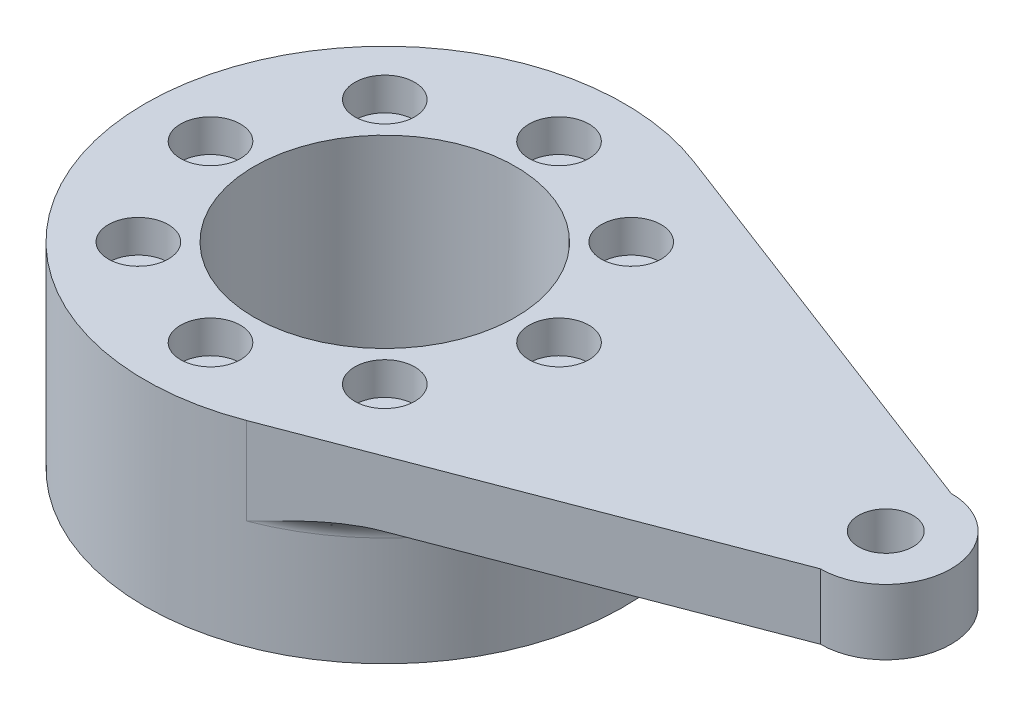
ISO-10303-21;
HEADER;
FILE_DESCRIPTION(('STEP AP214'),'2;1');
FILE_NAME('part.step','',(''),(''),'','','');
FILE_SCHEMA(('AUTOMOTIVE_DESIGN { 1 0 10303 214 1 1 1 1 }'));
ENDSEC;
DATA;
#1=APPLICATION_CONTEXT('core data for automotive mechanical design processes');
#2=APPLICATION_PROTOCOL_DEFINITION('international standard','automotive_design',2000,#1);
#3=PRODUCT_CONTEXT('',#1,'mechanical');
#4=PRODUCT('Part','Part','',(#3));
#5=PRODUCT_RELATED_PRODUCT_CATEGORY('part','',(#4));
#6=PRODUCT_DEFINITION_FORMATION('','',#4);
#7=PRODUCT_DEFINITION_CONTEXT('part definition',#1,'design');
#8=PRODUCT_DEFINITION('design','',#6,#7);
#9=PRODUCT_DEFINITION_SHAPE('','',#8);
#10=(LENGTH_UNIT() NAMED_UNIT(*) SI_UNIT(.MILLI.,.METRE.));
#11=(NAMED_UNIT(*) PLANE_ANGLE_UNIT() SI_UNIT($,.RADIAN.));
#12=(NAMED_UNIT(*) SI_UNIT($,.STERADIAN.) SOLID_ANGLE_UNIT());
#13=UNCERTAINTY_MEASURE_WITH_UNIT(LENGTH_MEASURE(1.E-05),#10,'distance_accuracy_value','');
#14=(GEOMETRIC_REPRESENTATION_CONTEXT(3) GLOBAL_UNCERTAINTY_ASSIGNED_CONTEXT((#13)) GLOBAL_UNIT_ASSIGNED_CONTEXT((#10,
#11,#12)) REPRESENTATION_CONTEXT('',''));
#15=CARTESIAN_POINT('',(0.,0.,0.));
#16=DIRECTION('',(0.,0.,1.));
#17=DIRECTION('',(1.,0.,0.));
#18=AXIS2_PLACEMENT_3D('',#15,#16,#17);
#19=CARTESIAN_POINT('',(-16.,12.,0.));
#20=DIRECTION('',(0.,-1.,0.));
#21=DIRECTION('',(0.,0.,-1.));
#22=AXIS2_PLACEMENT_3D('',#19,#20,#21);
#23=CYLINDRICAL_SURFACE('',#22,1.5);
#24=CARTESIAN_POINT('',(-16.,0.,0.));
#25=DIRECTION('',(0.,1.,0.));
#26=DIRECTION('',(0.,0.,1.));
#27=AXIS2_PLACEMENT_3D('',#24,#25,#26);
#28=CIRCLE('',#27,1.5);
#29=CARTESIAN_POINT('',(-16.,0.,1.5));
#30=VERTEX_POINT('',#29);
#31=EDGE_CURVE('E156',#30,#30,#28,.T.);
#32=ORIENTED_EDGE('',*,*,#31,.F.);
#33=EDGE_LOOP('',(#32));
#34=FACE_BOUND('',#33,.T.);
#35=CARTESIAN_POINT('',(-16.,15.,0.));
#36=DIRECTION('',(0.,1.,0.));
#37=DIRECTION('',(0.,0.,1.));
#38=AXIS2_PLACEMENT_3D('',#35,#36,#37);
#39=CIRCLE('',#38,1.5);
#40=CARTESIAN_POINT('',(-16.,15.,1.5));
#41=VERTEX_POINT('',#40);
#42=EDGE_CURVE('E288',#41,#41,#39,.F.);
#43=ORIENTED_EDGE('',*,*,#42,.F.);
#44=EDGE_LOOP('',(#43));
#45=FACE_BOUND('',#44,.T.);
#46=ADVANCED_FACE('F37',(#34,#45),#23,.F.);
#47=CARTESIAN_POINT('',(-11.3137084989847,12.,-11.3137084989848));
#48=DIRECTION('',(0.,-1.,0.));
#49=DIRECTION('',(0.,0.,-1.));
#50=AXIS2_PLACEMENT_3D('',#47,#48,#49);
#51=CYLINDRICAL_SURFACE('',#50,1.5);
#52=CARTESIAN_POINT('',(-11.3137084989847,0.,-11.3137084989848));
#53=DIRECTION('',(0.,1.,0.));
#54=DIRECTION('',(0.,0.,1.));
#55=AXIS2_PLACEMENT_3D('',#52,#53,#54);
#56=CIRCLE('',#55,1.5);
#57=CARTESIAN_POINT('',(-11.3137084989847,0.,-9.81370849898478));
#58=VERTEX_POINT('',#57);
#59=EDGE_CURVE('E153',#58,#58,#56,.T.);
#60=ORIENTED_EDGE('',*,*,#59,.F.);
#61=EDGE_LOOP('',(#60));
#62=FACE_BOUND('',#61,.T.);
#63=CARTESIAN_POINT('',(-11.3137084989847,15.,-11.3137084989848));
#64=DIRECTION('',(0.,1.,0.));
#65=DIRECTION('',(0.,0.,1.));
#66=AXIS2_PLACEMENT_3D('',#63,#64,#65);
#67=CIRCLE('',#66,1.5);
#68=CARTESIAN_POINT('',(-11.3137084989847,15.,-9.81370849898478));
#69=VERTEX_POINT('',#68);
#70=EDGE_CURVE('E261',#69,#69,#67,.F.);
#71=ORIENTED_EDGE('',*,*,#70,.F.);
#72=EDGE_LOOP('',(#71));
#73=FACE_BOUND('',#72,.T.);
#74=ADVANCED_FACE('F208',(#62,#73),#51,.F.);
#75=CARTESIAN_POINT('',(0.,12.,-16.));
#76=DIRECTION('',(0.,-1.,0.));
#77=DIRECTION('',(0.,0.,-1.));
#78=AXIS2_PLACEMENT_3D('',#75,#76,#77);
#79=CYLINDRICAL_SURFACE('',#78,1.5);
#80=CARTESIAN_POINT('',(0.,0.,-16.));
#81=DIRECTION('',(0.,1.,0.));
#82=DIRECTION('',(0.,0.,1.));
#83=AXIS2_PLACEMENT_3D('',#80,#81,#82);
#84=CIRCLE('',#83,1.5);
#85=CARTESIAN_POINT('',(0.,0.,-14.5));
#86=VERTEX_POINT('',#85);
#87=EDGE_CURVE('E150',#86,#86,#84,.T.);
#88=ORIENTED_EDGE('',*,*,#87,.F.);
#89=EDGE_LOOP('',(#88));
#90=FACE_BOUND('',#89,.T.);
#91=CARTESIAN_POINT('',(0.,15.,-16.));
#92=DIRECTION('',(0.,1.,0.));
#93=DIRECTION('',(0.,0.,1.));
#94=AXIS2_PLACEMENT_3D('',#91,#92,#93);
#95=CIRCLE('',#94,1.5);
#96=CARTESIAN_POINT('',(0.,15.,-14.5));
#97=VERTEX_POINT('',#96);
#98=EDGE_CURVE('E270',#97,#97,#95,.F.);
#99=ORIENTED_EDGE('',*,*,#98,.F.);
#100=EDGE_LOOP('',(#99));
#101=FACE_BOUND('',#100,.T.);
#102=ADVANCED_FACE('F204',(#90,#101),#79,.F.);
#103=CARTESIAN_POINT('',(11.3137084989848,12.,-11.3137084989847));
#104=DIRECTION('',(0.,-1.,0.));
#105=DIRECTION('',(0.,0.,-1.));
#106=AXIS2_PLACEMENT_3D('',#103,#104,#105);
#107=CYLINDRICAL_SURFACE('',#106,1.5);
#108=CARTESIAN_POINT('',(11.3137084989848,0.,-11.3137084989847));
#109=DIRECTION('',(0.,1.,0.));
#110=DIRECTION('',(0.,0.,1.));
#111=AXIS2_PLACEMENT_3D('',#108,#109,#110);
#112=CIRCLE('',#111,1.5);
#113=CARTESIAN_POINT('',(11.3137084989848,0.,-9.8137084989847));
#114=VERTEX_POINT('',#113);
#115=EDGE_CURVE('E147',#114,#114,#112,.T.);
#116=ORIENTED_EDGE('',*,*,#115,.F.);
#117=EDGE_LOOP('',(#116));
#118=FACE_BOUND('',#117,.T.);
#119=CARTESIAN_POINT('',(11.3137084989848,15.,-11.3137084989847));
#120=DIRECTION('',(0.,1.,0.));
#121=DIRECTION('',(0.,0.,1.));
#122=AXIS2_PLACEMENT_3D('',#119,#120,#121);
#123=CIRCLE('',#122,1.5);
#124=CARTESIAN_POINT('',(11.3137084989848,15.,-9.8137084989847));
#125=VERTEX_POINT('',#124);
#126=EDGE_CURVE('E279',#125,#125,#123,.F.);
#127=ORIENTED_EDGE('',*,*,#126,.F.);
#128=EDGE_LOOP('',(#127));
#129=FACE_BOUND('',#128,.T.);
#130=ADVANCED_FACE('F200',(#118,#129),#107,.F.);
#131=CARTESIAN_POINT('',(16.,12.,1.1172740284298E-13));
#132=DIRECTION('',(0.,-1.,0.));
#133=DIRECTION('',(0.,0.,-1.));
#134=AXIS2_PLACEMENT_3D('',#131,#132,#133);
#135=CYLINDRICAL_SURFACE('',#134,1.5);
#136=CARTESIAN_POINT('',(16.,0.,1.1172740284298E-13));
#137=DIRECTION('',(0.,1.,0.));
#138=DIRECTION('',(0.,0.,1.));
#139=AXIS2_PLACEMENT_3D('',#136,#137,#138);
#140=CIRCLE('',#139,1.5);
#141=CARTESIAN_POINT('',(16.,0.,1.50000000000011));
#142=VERTEX_POINT('',#141);
#143=EDGE_CURVE('E144',#142,#142,#140,.T.);
#144=ORIENTED_EDGE('',*,*,#143,.F.);
#145=EDGE_LOOP('',(#144));
#146=FACE_BOUND('',#145,.T.);
#147=CARTESIAN_POINT('',(16.,15.,1.1172740284298E-13));
#148=DIRECTION('',(0.,1.,0.));
#149=DIRECTION('',(0.,0.,1.));
#150=AXIS2_PLACEMENT_3D('',#147,#148,#149);
#151=CIRCLE('',#150,1.5);
#152=CARTESIAN_POINT('',(16.,15.,1.50000000000011));
#153=VERTEX_POINT('',#152);
#154=EDGE_CURVE('E437',#153,#153,#151,.F.);
#155=ORIENTED_EDGE('',*,*,#154,.F.);
#156=EDGE_LOOP('',(#155));
#157=FACE_BOUND('',#156,.T.);
#158=ADVANCED_FACE('F196',(#146,#157),#135,.F.);
#159=CARTESIAN_POINT('',(11.3137084989847,12.,11.3137084989849));
#160=DIRECTION('',(0.,-1.,0.));
#161=DIRECTION('',(0.,0.,-1.));
#162=AXIS2_PLACEMENT_3D('',#159,#160,#161);
#163=CYLINDRICAL_SURFACE('',#162,1.5);
#164=CARTESIAN_POINT('',(11.3137084989847,0.,11.3137084989849));
#165=DIRECTION('',(0.,1.,0.));
#166=DIRECTION('',(0.,0.,1.));
#167=AXIS2_PLACEMENT_3D('',#164,#165,#166);
#168=CIRCLE('',#167,1.5);
#169=CARTESIAN_POINT('',(11.3137084989847,0.,12.8137084989849));
#170=VERTEX_POINT('',#169);
#171=EDGE_CURVE('E141',#170,#170,#168,.T.);
#172=ORIENTED_EDGE('',*,*,#171,.F.);
#173=EDGE_LOOP('',(#172));
#174=FACE_BOUND('',#173,.T.);
#175=CARTESIAN_POINT('',(11.3137084989847,15.,11.3137084989849));
#176=DIRECTION('',(0.,1.,0.));
#177=DIRECTION('',(0.,0.,1.));
#178=AXIS2_PLACEMENT_3D('',#175,#176,#177);
#179=CIRCLE('',#178,1.5);
#180=CARTESIAN_POINT('',(11.3137084989847,15.,12.8137084989849));
#181=VERTEX_POINT('',#180);
#182=EDGE_CURVE('E446',#181,#181,#179,.F.);
#183=ORIENTED_EDGE('',*,*,#182,.F.);
#184=EDGE_LOOP('',(#183));
#185=FACE_BOUND('',#184,.T.);
#186=ADVANCED_FACE('F192',(#174,#185),#163,.F.);
#187=CARTESIAN_POINT('',(-1.6759110426447E-13,12.,16.));
#188=DIRECTION('',(0.,-1.,0.));
#189=DIRECTION('',(0.,0.,-1.));
#190=AXIS2_PLACEMENT_3D('',#187,#188,#189);
#191=CYLINDRICAL_SURFACE('',#190,1.5);
#192=CARTESIAN_POINT('',(-1.6759110426447E-13,0.,16.));
#193=DIRECTION('',(0.,1.,0.));
#194=DIRECTION('',(0.,0.,1.));
#195=AXIS2_PLACEMENT_3D('',#192,#193,#194);
#196=CIRCLE('',#195,1.5);
#197=CARTESIAN_POINT('',(-1.6759110426447E-13,0.,17.5));
#198=VERTEX_POINT('',#197);
#199=EDGE_CURVE('E138',#198,#198,#196,.T.);
#200=ORIENTED_EDGE('',*,*,#199,.F.);
#201=EDGE_LOOP('',(#200));
#202=FACE_BOUND('',#201,.T.);
#203=CARTESIAN_POINT('',(-1.6759110426447E-13,15.,16.));
#204=DIRECTION('',(0.,1.,0.));
#205=DIRECTION('',(0.,0.,1.));
#206=AXIS2_PLACEMENT_3D('',#203,#204,#205);
#207=CIRCLE('',#206,1.5);
#208=CARTESIAN_POINT('',(-1.6759110426447E-13,15.,17.5));
#209=VERTEX_POINT('',#208);
#210=EDGE_CURVE('E455',#209,#209,#207,.F.);
#211=ORIENTED_EDGE('',*,*,#210,.F.);
#212=EDGE_LOOP('',(#211));
#213=FACE_BOUND('',#212,.T.);
#214=ADVANCED_FACE('F188',(#202,#213),#191,.F.);
#215=CARTESIAN_POINT('',(-11.3137084989849,12.,11.3137084989846));
#216=DIRECTION('',(0.,-1.,0.));
#217=DIRECTION('',(0.,0.,-1.));
#218=AXIS2_PLACEMENT_3D('',#215,#216,#217);
#219=CYLINDRICAL_SURFACE('',#218,1.5);
#220=CARTESIAN_POINT('',(-11.3137084989849,0.,11.3137084989846));
#221=DIRECTION('',(0.,1.,0.));
#222=DIRECTION('',(0.,0.,1.));
#223=AXIS2_PLACEMENT_3D('',#220,#221,#222);
#224=CIRCLE('',#223,1.5);
#225=CARTESIAN_POINT('',(-11.3137084989849,0.,12.8137084989846));
#226=VERTEX_POINT('',#225);
#227=EDGE_CURVE('E98',#226,#226,#224,.T.);
#228=ORIENTED_EDGE('',*,*,#227,.F.);
#229=EDGE_LOOP('',(#228));
#230=FACE_BOUND('',#229,.T.);
#231=CARTESIAN_POINT('',(-11.3137084989849,15.,11.3137084989846));
#232=DIRECTION('',(0.,1.,0.));
#233=DIRECTION('',(0.,0.,1.));
#234=AXIS2_PLACEMENT_3D('',#231,#232,#233);
#235=CIRCLE('',#234,1.5);
#236=CARTESIAN_POINT('',(-11.3137084989849,15.,12.8137084989846));
#237=VERTEX_POINT('',#236);
#238=EDGE_CURVE('E246',#237,#237,#235,.F.);
#239=ORIENTED_EDGE('',*,*,#238,.F.);
#240=EDGE_LOOP('',(#239));
#241=FACE_BOUND('',#240,.T.);
#242=ADVANCED_FACE('F184',(#230,#241),#219,.F.);
#243=CARTESIAN_POINT('',(0.,0.,0.));
#244=DIRECTION('',(0.,1.,0.));
#245=DIRECTION('',(0.,0.,1.));
#246=AXIS2_PLACEMENT_3D('',#243,#244,#245);
#247=PLANE('',#246);
#248=CARTESIAN_POINT('',(0.,0.,0.));
#249=DIRECTION('',(0.,1.,0.));
#250=DIRECTION('',(0.,0.,1.));
#251=AXIS2_PLACEMENT_3D('',#248,#249,#250);
#252=CIRCLE('',#251,12.);
#253=CARTESIAN_POINT('',(0.,0.,12.));
#254=VERTEX_POINT('',#253);
#255=EDGE_CURVE('E430',#254,#254,#252,.T.);
#256=ORIENTED_EDGE('',*,*,#255,.T.);
#257=EDGE_LOOP('',(#256));
#258=FACE_BOUND('',#257,.T.);
#259=CARTESIAN_POINT('',(-6.1229349178416,0.,-14.7820725201805));
#260=DIRECTION('',(0.,-1.,0.));
#261=DIRECTION('',(0.,0.,-1.));
#262=AXIS2_PLACEMENT_3D('',#259,#260,#261);
#263=CIRCLE('',#262,2.05);
#264=CARTESIAN_POINT('',(-6.1229349178416,0.,-16.8320725201805));
#265=VERTEX_POINT('',#264);
#266=EDGE_CURVE('E298',#265,#265,#263,.T.);
#267=ORIENTED_EDGE('',*,*,#266,.F.);
#268=EDGE_LOOP('',(#267));
#269=FACE_BOUND('',#268,.T.);
#270=CARTESIAN_POINT('',(-14.7820725201806,0.,6.12293491784145));
#271=DIRECTION('',(0.,-1.,0.));
#272=DIRECTION('',(0.,0.,-1.));
#273=AXIS2_PLACEMENT_3D('',#270,#271,#272);
#274=CIRCLE('',#273,2.05);
#275=CARTESIAN_POINT('',(-14.7820725201806,0.,4.07293491784145));
#276=VERTEX_POINT('',#275);
#277=EDGE_CURVE('E304',#276,#276,#274,.T.);
#278=ORIENTED_EDGE('',*,*,#277,.F.);
#279=EDGE_LOOP('',(#278));
#280=FACE_BOUND('',#279,.T.);
#281=CARTESIAN_POINT('',(14.7820725201805,0.,-6.12293491784155));
#282=DIRECTION('',(0.,-1.,0.));
#283=DIRECTION('',(0.,0.,-1.));
#284=AXIS2_PLACEMENT_3D('',#281,#282,#283);
#285=CIRCLE('',#284,2.05);
#286=CARTESIAN_POINT('',(14.7820725201805,0.,-8.17293491784155));
#287=VERTEX_POINT('',#286);
#288=EDGE_CURVE('E310',#287,#287,#285,.T.);
#289=ORIENTED_EDGE('',*,*,#288,.F.);
#290=EDGE_LOOP('',(#289));
#291=FACE_BOUND('',#290,.T.);
#292=CARTESIAN_POINT('',(6.1229349178415,0.,14.7820725201806));
#293=DIRECTION('',(0.,-1.,0.));
#294=DIRECTION('',(0.,0.,-1.));
#295=AXIS2_PLACEMENT_3D('',#292,#293,#294);
#296=CIRCLE('',#295,2.05);
#297=CARTESIAN_POINT('',(6.1229349178415,0.,12.7320725201806));
#298=VERTEX_POINT('',#297);
#299=EDGE_CURVE('E119',#298,#298,#296,.T.);
#300=ORIENTED_EDGE('',*,*,#299,.F.);
#301=EDGE_LOOP('',(#300));
#302=FACE_BOUND('',#301,.T.);
#303=CARTESIAN_POINT('',(0.,0.,0.));
#304=DIRECTION('',(0.,1.,0.));
#305=DIRECTION('',(0.,0.,1.));
#306=AXIS2_PLACEMENT_3D('',#303,#304,#305);
#307=CIRCLE('',#306,22.);
#308=CARTESIAN_POINT('',(0.,0.,22.));
#309=VERTEX_POINT('',#308);
#310=EDGE_CURVE('E159',#309,#309,#307,.T.);
#311=ORIENTED_EDGE('',*,*,#310,.F.);
#312=EDGE_LOOP('',(#311));
#313=FACE_BOUND('',#312,.T.);
#314=ORIENTED_EDGE('',*,*,#31,.T.);
#315=EDGE_LOOP('',(#314));
#316=FACE_BOUND('',#315,.T.);
#317=ORIENTED_EDGE('',*,*,#59,.T.);
#318=EDGE_LOOP('',(#317));
#319=FACE_BOUND('',#318,.T.);
#320=ORIENTED_EDGE('',*,*,#87,.T.);
#321=EDGE_LOOP('',(#320));
#322=FACE_BOUND('',#321,.T.);
#323=ORIENTED_EDGE('',*,*,#115,.T.);
#324=EDGE_LOOP('',(#323));
#325=FACE_BOUND('',#324,.T.);
#326=ORIENTED_EDGE('',*,*,#143,.T.);
#327=EDGE_LOOP('',(#326));
#328=FACE_BOUND('',#327,.T.);
#329=ORIENTED_EDGE('',*,*,#171,.T.);
#330=EDGE_LOOP('',(#329));
#331=FACE_BOUND('',#330,.T.);
#332=ORIENTED_EDGE('',*,*,#199,.T.);
#333=EDGE_LOOP('',(#332));
#334=FACE_BOUND('',#333,.T.);
#335=ORIENTED_EDGE('',*,*,#227,.T.);
#336=EDGE_LOOP('',(#335));
#337=FACE_BOUND('',#336,.T.);
#338=ADVANCED_FACE('F187',(#258,#269,#280,#291,#302,#313,#316,#319,#322,#325,#328,#331,#334,
#337),#247,.F.);
#339=CARTESIAN_POINT('',(0.,12.,0.));
#340=DIRECTION('',(0.,-1.,0.));
#341=DIRECTION('',(0.,0.,-1.));
#342=AXIS2_PLACEMENT_3D('',#339,#340,#341);
#343=CYLINDRICAL_SURFACE('',#342,22.);
#344=DIRECTION('',(0.,-1.,0.));
#345=VECTOR('',#344,1.);
#346=CARTESIAN_POINT('',(7.84059825550241,18.,-20.5554133744815));
#347=LINE('',#346,#345);
#348=CARTESIAN_POINT('',(7.84059825550241,18.,-20.5554133744815));
#349=VERTEX_POINT('',#348);
#350=CARTESIAN_POINT('',(7.84059825550241,10.,-20.5554133744815));
#351=VERTEX_POINT('',#350);
#352=EDGE_CURVE('E58',#349,#351,#347,.T.);
#353=ORIENTED_EDGE('',*,*,#352,.T.);
#354=CARTESIAN_POINT('',(0.,10.,0.));
#355=DIRECTION('',(0.,1.,0.));
#356=DIRECTION('',(0.,0.,1.));
#357=AXIS2_PLACEMENT_3D('',#354,#355,#356);
#358=CIRCLE('',#357,22.);
#359=CARTESIAN_POINT('',(7.84059825550241,10.,20.5554133744815));
#360=VERTEX_POINT('',#359);
#361=EDGE_CURVE('E165',#351,#360,#358,.F.);
#362=ORIENTED_EDGE('',*,*,#361,.T.);
#363=DIRECTION('',(0.,-1.,0.));
#364=VECTOR('',#363,1.);
#365=CARTESIAN_POINT('',(7.84059825550241,18.,20.5554133744815));
#366=LINE('',#365,#364);
#367=CARTESIAN_POINT('',(7.84059825550241,18.,20.5554133744815));
#368=VERTEX_POINT('',#367);
#369=EDGE_CURVE('E65',#368,#360,#366,.T.);
#370=ORIENTED_EDGE('',*,*,#369,.F.);
#371=CARTESIAN_POINT('',(0.,18.,0.));
#372=DIRECTION('',(0.,1.,0.));
#373=DIRECTION('',(0.,0.,1.));
#374=AXIS2_PLACEMENT_3D('',#371,#372,#373);
#375=CIRCLE('',#374,22.);
#376=EDGE_CURVE('E112',#349,#368,#375,.T.);
#377=ORIENTED_EDGE('',*,*,#376,.F.);
#378=EDGE_LOOP('',(#353,#362,#370,#377));
#379=FACE_BOUND('',#378,.T.);
#380=ORIENTED_EDGE('',*,*,#310,.T.);
#381=EDGE_LOOP('',(#380));
#382=FACE_BOUND('',#381,.T.);
#383=ADVANCED_FACE('F217',(#379,#382),#343,.T.);
#384=CARTESIAN_POINT('',(0.,12.,0.));
#385=DIRECTION('',(0.,1.,0.));
#386=DIRECTION('',(0.,0.,1.));
#387=AXIS2_PLACEMENT_3D('',#384,#385,#386);
#388=PLANE('',#387);
#389=CARTESIAN_POINT('',(46.,12.,0.));
#390=DIRECTION('',(0.,1.,0.));
#391=DIRECTION('',(0.,0.,1.));
#392=AXIS2_PLACEMENT_3D('',#389,#390,#391);
#393=CIRCLE('',#392,2.5);
#394=CARTESIAN_POINT('',(46.,12.,2.5));
#395=VERTEX_POINT('',#394);
#396=EDGE_CURVE('E113',#395,#395,#393,.T.);
#397=ORIENTED_EDGE('',*,*,#396,.T.);
#398=EDGE_LOOP('',(#397));
#399=FACE_BOUND('',#398,.T.);
#400=DIRECTION('',(-0.93433697156734,0.,0.356390829795564));
#401=VECTOR('',#400,1.);
#402=CARTESIAN_POINT('',(7.84059825550241,12.,20.5554133744815));
#403=LINE('',#402,#401);
#404=CARTESIAN_POINT('',(46.,12.,6.));
#405=VERTEX_POINT('',#404);
#406=CARTESIAN_POINT('',(16.8024436587808,12.,17.1370326221752));
#407=VERTEX_POINT('',#406);
#408=EDGE_CURVE('E94',#405,#407,#403,.T.);
#409=ORIENTED_EDGE('',*,*,#408,.T.);
#410=CARTESIAN_POINT('',(0.,12.,0.));
#411=DIRECTION('',(0.,1.,0.));
#412=DIRECTION('',(0.,0.,1.));
#413=AXIS2_PLACEMENT_3D('',#410,#411,#412);
#414=CIRCLE('',#413,24.);
#415=CARTESIAN_POINT('',(16.8024436587808,12.,-17.1370326221752));
#416=VERTEX_POINT('',#415);
#417=EDGE_CURVE('E162',#407,#416,#414,.T.);
#418=ORIENTED_EDGE('',*,*,#417,.T.);
#419=DIRECTION('',(-0.93433697156734,0.,-0.356390829795564));
#420=VECTOR('',#419,1.);
#421=CARTESIAN_POINT('',(7.84059825550241,12.,-20.5554133744815));
#422=LINE('',#421,#420);
#423=CARTESIAN_POINT('',(46.,12.,-6.));
#424=VERTEX_POINT('',#423);
#425=EDGE_CURVE('E116',#424,#416,#422,.T.);
#426=ORIENTED_EDGE('',*,*,#425,.F.);
#427=CARTESIAN_POINT('',(46.,12.,0.));
#428=DIRECTION('',(0.,1.,0.));
#429=DIRECTION('',(0.,0.,1.));
#430=AXIS2_PLACEMENT_3D('',#427,#428,#429);
#431=CIRCLE('',#430,6.);
#432=EDGE_CURVE('E128',#405,#424,#431,.T.);
#433=ORIENTED_EDGE('',*,*,#432,.F.);
#434=EDGE_LOOP('',(#409,#418,#426,#433));
#435=FACE_BOUND('',#434,.T.);
#436=ADVANCED_FACE('F183',(#399,#435),#388,.F.);
#437=CARTESIAN_POINT('',(7.84059825550241,18.,20.5554133744815));
#438=DIRECTION('',(0.356390829795564,0.,0.93433697156734));
#439=DIRECTION('',(0.934336971567341,0.,-0.356390829795564));
#440=AXIS2_PLACEMENT_3D('',#437,#438,#439);
#441=PLANE('',#440);
#442=ORIENTED_EDGE('',*,*,#408,.F.);
#443=DIRECTION('',(0.,-1.,0.));
#444=VECTOR('',#443,1.);
#445=CARTESIAN_POINT('',(46.,18.,6.));
#446=LINE('',#445,#444);
#447=CARTESIAN_POINT('',(46.,18.,6.));
#448=VERTEX_POINT('',#447);
#449=EDGE_CURVE('E88',#448,#405,#446,.T.);
#450=ORIENTED_EDGE('',*,*,#449,.F.);
#451=DIRECTION('',(-0.93433697156734,0.,0.356390829795564));
#452=VECTOR('',#451,1.);
#453=CARTESIAN_POINT('',(7.84059825550241,18.,20.5554133744815));
#454=LINE('',#453,#452);
#455=EDGE_CURVE('E92',#448,#368,#454,.T.);
#456=ORIENTED_EDGE('',*,*,#455,.T.);
#457=ORIENTED_EDGE('',*,*,#369,.T.);
#458=CARTESIAN_POINT('',(16.8024436587808,12.,17.1370326221752));
#459=CARTESIAN_POINT('',(16.6447027714641,11.9999762948153,17.1972008563715));
#460=CARTESIAN_POINT('',(16.486989567504,11.9965866675517,17.2573585311071));
#461=CARTESIAN_POINT('',(16.1718203242431,11.9838003751437,17.3775757884242));
#462=CARTESIAN_POINT('',(16.0143642209264,11.9744055518785,17.4376353954237));
#463=CARTESIAN_POINT('',(15.7000352549024,11.9503496997234,17.557532139788));
#464=CARTESIAN_POINT('',(15.5431618833756,11.9356960954993,17.6173694712354));
#465=CARTESIAN_POINT('',(15.2298514174152,11.9017004091527,17.73687772184));
#466=CARTESIAN_POINT('',(15.0734143619755,11.8823579207548,17.7965486261235));
#467=CARTESIAN_POINT('',(14.6065213430878,11.8183145852962,17.9746389677141));
#468=CARTESIAN_POINT('',(14.2967966939894,11.7674570730959,18.0927794545613));
#469=CARTESIAN_POINT('',(13.679402370757,11.6526128471442,18.3282765844659));
#470=CARTESIAN_POINT('',(13.3717336256647,11.5886205641736,18.4456328731523));
#471=CARTESIAN_POINT('',(12.6260706411212,11.4203652927699,18.7300564354175));
#472=CARTESIAN_POINT('',(12.1891587086289,11.3106439280728,18.8967108769167));
#473=CARTESIAN_POINT('',(11.3189029453068,11.0763949836736,19.2286587533926));
#474=CARTESIAN_POINT('',(10.8855590284351,10.9518677621369,19.393952221189));
#475=CARTESIAN_POINT('',(9.58798236063764,10.5638342234291,19.8888961647899));
#476=CARTESIAN_POINT('',(8.72749804892183,10.2862028437589,20.2171168466324));
#477=CARTESIAN_POINT('',(7.85828953115385,10.0057089732058,20.5486652647508));
#478=CARTESIAN_POINT('',(7.84944388955644,10.0028544768059,20.5520393210548));
#479=CARTESIAN_POINT('',(7.84059825550242,10.,20.5554133744815));
#480=B_SPLINE_CURVE_WITH_KNOTS('',3,(#458,#459,#460,#461,#462,#463,#464,#465,#466,#467,#468,
#469,#470,#471,#472,#473,#474,#475,#476,#477,#478,#479),.UNSPECIFIED.,.F.,.F.,(4,2,2,2,2,2,2,2,
2,2,4),(0.,0.506403608546306,1.01265197037599,1.51818837400446,2.02376859625181,
3.02950309914149,4.03566492350481,5.47622525419607,6.91675074369697,9.80206434583899,
9.83172913978732),.UNSPECIFIED.);
#481=EDGE_CURVE('E11',#360,#407,#480,.F.);
#482=ORIENTED_EDGE('',*,*,#481,.T.);
#483=EDGE_LOOP('',(#442,#450,#456,#457,#482));
#484=FACE_BOUND('',#483,.T.);
#485=ADVANCED_FACE('F90',(#484),#441,.T.);
#486=CARTESIAN_POINT('',(46.,18.,0.));
#487=DIRECTION('',(0.,-1.,0.));
#488=DIRECTION('',(0.,0.,-1.));
#489=AXIS2_PLACEMENT_3D('',#486,#487,#488);
#490=CYLINDRICAL_SURFACE('',#489,6.);
#491=ORIENTED_EDGE('',*,*,#432,.T.);
#492=DIRECTION('',(0.,-1.,0.));
#493=VECTOR('',#492,1.);
#494=CARTESIAN_POINT('',(46.,18.,-6.));
#495=LINE('',#494,#493);
#496=CARTESIAN_POINT('',(46.,18.,-6.));
#497=VERTEX_POINT('',#496);
#498=EDGE_CURVE('E99',#497,#424,#495,.T.);
#499=ORIENTED_EDGE('',*,*,#498,.F.);
#500=CARTESIAN_POINT('',(46.,18.,0.));
#501=DIRECTION('',(0.,1.,0.));
#502=DIRECTION('',(0.,0.,1.));
#503=AXIS2_PLACEMENT_3D('',#500,#501,#502);
#504=CIRCLE('',#503,6.);
#505=EDGE_CURVE('E103',#448,#497,#504,.T.);
#506=ORIENTED_EDGE('',*,*,#505,.F.);
#507=ORIENTED_EDGE('',*,*,#449,.T.);
#508=EDGE_LOOP('',(#491,#499,#506,#507));
#509=FACE_BOUND('',#508,.T.);
#510=ADVANCED_FACE('F104',(#509),#490,.T.);
#511=CARTESIAN_POINT('',(7.84059825550241,18.,-20.5554133744815));
#512=DIRECTION('',(-0.356390829795564,0.,0.93433697156734));
#513=DIRECTION('',(0.934336971567341,0.,0.356390829795564));
#514=AXIS2_PLACEMENT_3D('',#511,#512,#513);
#515=PLANE('',#514);
#516=ORIENTED_EDGE('',*,*,#425,.T.);
#517=CARTESIAN_POINT('',(16.8024436587808,12.,-17.1370326221752));
#518=CARTESIAN_POINT('',(16.6447027714641,11.9999762948153,-17.1972008563715));
#519=CARTESIAN_POINT('',(16.486989567504,11.9965866675517,-17.2573585311071));
#520=CARTESIAN_POINT('',(16.1718203242431,11.9838003751437,-17.3775757884242));
#521=CARTESIAN_POINT('',(16.0143642209264,11.9744055518785,-17.4376353954237));
#522=CARTESIAN_POINT('',(15.7000352549024,11.9503496997234,-17.557532139788));
#523=CARTESIAN_POINT('',(15.5431618833756,11.9356960954993,-17.6173694712354));
#524=CARTESIAN_POINT('',(15.2298514174152,11.9017004091527,-17.73687772184));
#525=CARTESIAN_POINT('',(15.0734143619755,11.8823579207548,-17.7965486261235));
#526=CARTESIAN_POINT('',(14.6065213430878,11.8183145852962,-17.9746389677141));
#527=CARTESIAN_POINT('',(14.2967966939894,11.7674570730959,-18.0927794545613));
#528=CARTESIAN_POINT('',(13.679402370757,11.6526128471442,-18.3282765844659));
#529=CARTESIAN_POINT('',(13.3717336256647,11.5886205641736,-18.4456328731523));
#530=CARTESIAN_POINT('',(12.6260706411212,11.4203652927699,-18.7300564354175));
#531=CARTESIAN_POINT('',(12.1891587086289,11.3106439280728,-18.8967108769167));
#532=CARTESIAN_POINT('',(11.3189029453068,11.0763949836736,-19.2286587533926));
#533=CARTESIAN_POINT('',(10.8855590284351,10.9518677621369,-19.393952221189));
#534=CARTESIAN_POINT('',(9.58798236063764,10.5638342234291,-19.8888961647899));
#535=CARTESIAN_POINT('',(8.72749804892183,10.2862028437589,-20.2171168466324));
#536=CARTESIAN_POINT('',(7.85828953115385,10.0057089732058,-20.5486652647508));
#537=CARTESIAN_POINT('',(7.84944388955644,10.0028544768059,-20.5520393210548));
#538=CARTESIAN_POINT('',(7.84059825550242,10.,-20.5554133744815));
#539=B_SPLINE_CURVE_WITH_KNOTS('',3,(#517,#518,#519,#520,#521,#522,#523,#524,#525,#526,#527,
#528,#529,#530,#531,#532,#533,#534,#535,#536,#537,#538),.UNSPECIFIED.,.F.,.F.,(4,2,2,2,2,2,2,2,
2,2,4),(0.,0.506403608546306,1.01265197037599,1.51818837400446,2.02376859625181,
3.02950309914149,4.03566492350481,5.47622525419607,6.91675074369697,9.80206434583899,
9.83172913978732),.UNSPECIFIED.);
#540=EDGE_CURVE('E51',#416,#351,#539,.T.);
#541=ORIENTED_EDGE('',*,*,#540,.T.);
#542=ORIENTED_EDGE('',*,*,#352,.F.);
#543=DIRECTION('',(-0.93433697156734,0.,-0.356390829795564));
#544=VECTOR('',#543,1.);
#545=CARTESIAN_POINT('',(7.84059825550241,18.,-20.5554133744815));
#546=LINE('',#545,#544);
#547=EDGE_CURVE('E108',#497,#349,#546,.T.);
#548=ORIENTED_EDGE('',*,*,#547,.F.);
#549=ORIENTED_EDGE('',*,*,#498,.T.);
#550=EDGE_LOOP('',(#516,#541,#542,#548,#549));
#551=FACE_BOUND('',#550,.T.);
#552=ADVANCED_FACE('F171',(#551),#515,.F.);
#553=CARTESIAN_POINT('',(46.,18.,0.));
#554=DIRECTION('',(0.,-1.,0.));
#555=DIRECTION('',(0.,0.,-1.));
#556=AXIS2_PLACEMENT_3D('',#553,#554,#555);
#557=CYLINDRICAL_SURFACE('',#556,2.5);
#558=CARTESIAN_POINT('',(46.,18.,0.));
#559=DIRECTION('',(0.,1.,0.));
#560=DIRECTION('',(0.,0.,1.));
#561=AXIS2_PLACEMENT_3D('',#558,#559,#560);
#562=CIRCLE('',#561,2.5);
#563=CARTESIAN_POINT('',(46.,18.,2.5));
#564=VERTEX_POINT('',#563);
#565=EDGE_CURVE('E124',#564,#564,#562,.T.);
#566=ORIENTED_EDGE('',*,*,#565,.T.);
#567=EDGE_LOOP('',(#566));
#568=FACE_BOUND('',#567,.T.);
#569=ORIENTED_EDGE('',*,*,#396,.F.);
#570=EDGE_LOOP('',(#569));
#571=FACE_BOUND('',#570,.T.);
#572=ADVANCED_FACE('F176',(#568,#571),#557,.F.);
#573=CARTESIAN_POINT('',(0.,18.,0.));
#574=DIRECTION('',(0.,1.,0.));
#575=DIRECTION('',(0.,0.,1.));
#576=AXIS2_PLACEMENT_3D('',#573,#574,#575);
#577=PLANE('',#576);
#578=CARTESIAN_POINT('',(0.,18.,0.));
#579=DIRECTION('',(0.,1.,0.));
#580=DIRECTION('',(0.,0.,1.));
#581=AXIS2_PLACEMENT_3D('',#578,#579,#580);
#582=CIRCLE('',#581,12.);
#583=CARTESIAN_POINT('',(0.,18.,12.));
#584=VERTEX_POINT('',#583);
#585=EDGE_CURVE('E433',#584,#584,#582,.T.);
#586=ORIENTED_EDGE('',*,*,#585,.F.);
#587=EDGE_LOOP('',(#586));
#588=FACE_BOUND('',#587,.T.);
#589=CARTESIAN_POINT('',(-11.3137084989849,18.,11.3137084989846));
#590=DIRECTION('',(0.,1.,0.));
#591=DIRECTION('',(0.,0.,1.));
#592=AXIS2_PLACEMENT_3D('',#589,#590,#591);
#593=CIRCLE('',#592,2.75);
#594=CARTESIAN_POINT('',(-11.3137084989849,18.,14.0637084989846));
#595=VERTEX_POINT('',#594);
#596=EDGE_CURVE('E249',#595,#595,#593,.T.);
#597=ORIENTED_EDGE('',*,*,#596,.F.);
#598=EDGE_LOOP('',(#597));
#599=FACE_BOUND('',#598,.T.);
#600=CARTESIAN_POINT('',(-11.3137084989847,18.,-11.3137084989848));
#601=DIRECTION('',(0.,1.,0.));
#602=DIRECTION('',(0.,0.,1.));
#603=AXIS2_PLACEMENT_3D('',#600,#601,#602);
#604=CIRCLE('',#603,2.75);
#605=CARTESIAN_POINT('',(-11.3137084989847,18.,-8.56370849898479));
#606=VERTEX_POINT('',#605);
#607=EDGE_CURVE('E264',#606,#606,#604,.T.);
#608=ORIENTED_EDGE('',*,*,#607,.F.);
#609=EDGE_LOOP('',(#608));
#610=FACE_BOUND('',#609,.T.);
#611=CARTESIAN_POINT('',(0.,18.,-16.));
#612=DIRECTION('',(0.,1.,0.));
#613=DIRECTION('',(0.,0.,1.));
#614=AXIS2_PLACEMENT_3D('',#611,#612,#613);
#615=CIRCLE('',#614,2.75);
#616=CARTESIAN_POINT('',(0.,18.,-13.25));
#617=VERTEX_POINT('',#616);
#618=EDGE_CURVE('E273',#617,#617,#615,.T.);
#619=ORIENTED_EDGE('',*,*,#618,.F.);
#620=EDGE_LOOP('',(#619));
#621=FACE_BOUND('',#620,.T.);
#622=CARTESIAN_POINT('',(11.3137084989848,18.,-11.3137084989847));
#623=DIRECTION('',(0.,1.,0.));
#624=DIRECTION('',(0.,0.,1.));
#625=AXIS2_PLACEMENT_3D('',#622,#623,#624);
#626=CIRCLE('',#625,2.75);
#627=CARTESIAN_POINT('',(11.3137084989848,18.,-8.5637084989847));
#628=VERTEX_POINT('',#627);
#629=EDGE_CURVE('E282',#628,#628,#626,.T.);
#630=ORIENTED_EDGE('',*,*,#629,.F.);
#631=EDGE_LOOP('',(#630));
#632=FACE_BOUND('',#631,.T.);
#633=CARTESIAN_POINT('',(16.,18.,1.1172740284298E-13));
#634=DIRECTION('',(0.,1.,0.));
#635=DIRECTION('',(0.,0.,1.));
#636=AXIS2_PLACEMENT_3D('',#633,#634,#635);
#637=CIRCLE('',#636,2.75);
#638=CARTESIAN_POINT('',(16.,18.,2.75000000000011));
#639=VERTEX_POINT('',#638);
#640=EDGE_CURVE('E440',#639,#639,#637,.T.);
#641=ORIENTED_EDGE('',*,*,#640,.F.);
#642=EDGE_LOOP('',(#641));
#643=FACE_BOUND('',#642,.T.);
#644=CARTESIAN_POINT('',(11.3137084989847,18.,11.3137084989849));
#645=DIRECTION('',(0.,1.,0.));
#646=DIRECTION('',(0.,0.,1.));
#647=AXIS2_PLACEMENT_3D('',#644,#645,#646);
#648=CIRCLE('',#647,2.75);
#649=CARTESIAN_POINT('',(11.3137084989847,18.,14.0637084989849));
#650=VERTEX_POINT('',#649);
#651=EDGE_CURVE('E449',#650,#650,#648,.T.);
#652=ORIENTED_EDGE('',*,*,#651,.F.);
#653=EDGE_LOOP('',(#652));
#654=FACE_BOUND('',#653,.T.);
#655=CARTESIAN_POINT('',(-1.6759110426447E-13,18.,16.));
#656=DIRECTION('',(0.,1.,0.));
#657=DIRECTION('',(0.,0.,1.));
#658=AXIS2_PLACEMENT_3D('',#655,#656,#657);
#659=CIRCLE('',#658,2.75);
#660=CARTESIAN_POINT('',(-1.6759110426447E-13,18.,18.75));
#661=VERTEX_POINT('',#660);
#662=EDGE_CURVE('E258',#661,#661,#659,.T.);
#663=ORIENTED_EDGE('',*,*,#662,.F.);
#664=EDGE_LOOP('',(#663));
#665=FACE_BOUND('',#664,.T.);
#666=CARTESIAN_POINT('',(-16.,18.,0.));
#667=DIRECTION('',(0.,1.,0.));
#668=DIRECTION('',(0.,0.,1.));
#669=AXIS2_PLACEMENT_3D('',#666,#667,#668);
#670=CIRCLE('',#669,2.75);
#671=CARTESIAN_POINT('',(-16.,18.,2.75));
#672=VERTEX_POINT('',#671);
#673=EDGE_CURVE('E252',#672,#672,#670,.T.);
#674=ORIENTED_EDGE('',*,*,#673,.F.);
#675=EDGE_LOOP('',(#674));
#676=FACE_BOUND('',#675,.T.);
#677=ORIENTED_EDGE('',*,*,#455,.F.);
#678=ORIENTED_EDGE('',*,*,#505,.T.);
#679=ORIENTED_EDGE('',*,*,#547,.T.);
#680=ORIENTED_EDGE('',*,*,#376,.T.);
#681=EDGE_LOOP('',(#677,#678,#679,#680));
#682=FACE_BOUND('',#681,.T.);
#683=ORIENTED_EDGE('',*,*,#565,.F.);
#684=EDGE_LOOP('',(#683));
#685=FACE_BOUND('',#684,.T.);
#686=ADVANCED_FACE('F110',(#588,#599,#610,#621,#632,#643,#654,#665,#676,#682,#685),#577,.T.);
#687=CARTESIAN_POINT('',(6.1229349178415,3.5,14.7820725201806));
#688=DIRECTION('',(0.,-1.,0.));
#689=DIRECTION('',(0.,0.,-1.));
#690=AXIS2_PLACEMENT_3D('',#687,#688,#689);
#691=CYLINDRICAL_SURFACE('',#690,2.05);
#692=CARTESIAN_POINT('',(6.1229349178415,3.5,14.7820725201806));
#693=DIRECTION('',(0.,-1.,0.));
#694=DIRECTION('',(0.,0.,-1.));
#695=AXIS2_PLACEMENT_3D('',#692,#693,#694);
#696=CIRCLE('',#695,2.05);
#697=CARTESIAN_POINT('',(6.1229349178415,3.5,12.7320725201806));
#698=VERTEX_POINT('',#697);
#699=EDGE_CURVE('E312',#698,#698,#696,.T.);
#700=ORIENTED_EDGE('',*,*,#699,.F.);
#701=EDGE_LOOP('',(#700));
#702=FACE_BOUND('',#701,.T.);
#703=ORIENTED_EDGE('',*,*,#299,.T.);
#704=EDGE_LOOP('',(#703));
#705=FACE_BOUND('',#704,.T.);
#706=ADVANCED_FACE('F319',(#702,#705),#691,.F.);
#707=CARTESIAN_POINT('',(0.,3.5,0.));
#708=DIRECTION('',(0.,-1.,0.));
#709=DIRECTION('',(0.,0.,-1.));
#710=AXIS2_PLACEMENT_3D('',#707,#708,#709);
#711=PLANE('',#710);
#712=ORIENTED_EDGE('',*,*,#699,.T.);
#713=EDGE_LOOP('',(#712));
#714=FACE_BOUND('',#713,.T.);
#715=ADVANCED_FACE('F322',(#714),#711,.T.);
#716=CARTESIAN_POINT('',(14.7820725201805,3.5,-6.12293491784155));
#717=DIRECTION('',(0.,-1.,0.));
#718=DIRECTION('',(0.,0.,-1.));
#719=AXIS2_PLACEMENT_3D('',#716,#717,#718);
#720=CYLINDRICAL_SURFACE('',#719,2.05);
#721=CARTESIAN_POINT('',(14.7820725201805,3.5,-6.12293491784155));
#722=DIRECTION('',(0.,-1.,0.));
#723=DIRECTION('',(0.,0.,-1.));
#724=AXIS2_PLACEMENT_3D('',#721,#722,#723);
#725=CIRCLE('',#724,2.05);
#726=CARTESIAN_POINT('',(14.7820725201805,3.5,-8.17293491784155));
#727=VERTEX_POINT('',#726);
#728=EDGE_CURVE('E307',#727,#727,#725,.T.);
#729=ORIENTED_EDGE('',*,*,#728,.F.);
#730=EDGE_LOOP('',(#729));
#731=FACE_BOUND('',#730,.T.);
#732=ORIENTED_EDGE('',*,*,#288,.T.);
#733=EDGE_LOOP('',(#732));
#734=FACE_BOUND('',#733,.T.);
#735=ADVANCED_FACE('F329',(#731,#734),#720,.F.);
#736=CARTESIAN_POINT('',(0.,3.5,0.));
#737=DIRECTION('',(0.,-1.,0.));
#738=DIRECTION('',(0.,0.,-1.));
#739=AXIS2_PLACEMENT_3D('',#736,#737,#738);
#740=PLANE('',#739);
#741=ORIENTED_EDGE('',*,*,#728,.T.);
#742=EDGE_LOOP('',(#741));
#743=FACE_BOUND('',#742,.T.);
#744=ADVANCED_FACE('F336',(#743),#740,.T.);
#745=CARTESIAN_POINT('',(-14.7820725201806,3.5,6.12293491784145));
#746=DIRECTION('',(0.,-1.,0.));
#747=DIRECTION('',(0.,0.,-1.));
#748=AXIS2_PLACEMENT_3D('',#745,#746,#747);
#749=CYLINDRICAL_SURFACE('',#748,2.05);
#750=CARTESIAN_POINT('',(-14.7820725201806,3.5,6.12293491784145));
#751=DIRECTION('',(0.,-1.,0.));
#752=DIRECTION('',(0.,0.,-1.));
#753=AXIS2_PLACEMENT_3D('',#750,#751,#752);
#754=CIRCLE('',#753,2.05);
#755=CARTESIAN_POINT('',(-14.7820725201806,3.5,4.07293491784145));
#756=VERTEX_POINT('',#755);
#757=EDGE_CURVE('E301',#756,#756,#754,.T.);
#758=ORIENTED_EDGE('',*,*,#757,.F.);
#759=EDGE_LOOP('',(#758));
#760=FACE_BOUND('',#759,.T.);
#761=ORIENTED_EDGE('',*,*,#277,.T.);
#762=EDGE_LOOP('',(#761));
#763=FACE_BOUND('',#762,.T.);
#764=ADVANCED_FACE('F340',(#760,#763),#749,.F.);
#765=CARTESIAN_POINT('',(0.,3.5,0.));
#766=DIRECTION('',(0.,-1.,0.));
#767=DIRECTION('',(0.,0.,-1.));
#768=AXIS2_PLACEMENT_3D('',#765,#766,#767);
#769=PLANE('',#768);
#770=ORIENTED_EDGE('',*,*,#757,.T.);
#771=EDGE_LOOP('',(#770));
#772=FACE_BOUND('',#771,.T.);
#773=ADVANCED_FACE('F344',(#772),#769,.T.);
#774=CARTESIAN_POINT('',(-6.1229349178416,3.5,-14.7820725201805));
#775=DIRECTION('',(0.,-1.,0.));
#776=DIRECTION('',(0.,0.,-1.));
#777=AXIS2_PLACEMENT_3D('',#774,#775,#776);
#778=CYLINDRICAL_SURFACE('',#777,2.05);
#779=CARTESIAN_POINT('',(-6.1229349178416,3.5,-14.7820725201805));
#780=DIRECTION('',(0.,-1.,0.));
#781=DIRECTION('',(0.,0.,-1.));
#782=AXIS2_PLACEMENT_3D('',#779,#780,#781);
#783=CIRCLE('',#782,2.05);
#784=CARTESIAN_POINT('',(-6.1229349178416,3.5,-16.8320725201805));
#785=VERTEX_POINT('',#784);
#786=EDGE_CURVE('E129',#785,#785,#783,.T.);
#787=ORIENTED_EDGE('',*,*,#786,.F.);
#788=EDGE_LOOP('',(#787));
#789=FACE_BOUND('',#788,.T.);
#790=ORIENTED_EDGE('',*,*,#266,.T.);
#791=EDGE_LOOP('',(#790));
#792=FACE_BOUND('',#791,.T.);
#793=ADVANCED_FACE('F348',(#789,#792),#778,.F.);
#794=CARTESIAN_POINT('',(0.,3.5,0.));
#795=DIRECTION('',(0.,-1.,0.));
#796=DIRECTION('',(0.,0.,-1.));
#797=AXIS2_PLACEMENT_3D('',#794,#795,#796);
#798=PLANE('',#797);
#799=ORIENTED_EDGE('',*,*,#786,.T.);
#800=EDGE_LOOP('',(#799));
#801=FACE_BOUND('',#800,.T.);
#802=ADVANCED_FACE('F352',(#801),#798,.T.);
#803=CARTESIAN_POINT('',(-16.,15.,0.));
#804=DIRECTION('',(0.,1.,0.));
#805=DIRECTION('',(0.,0.,1.));
#806=AXIS2_PLACEMENT_3D('',#803,#804,#805);
#807=CYLINDRICAL_SURFACE('',#806,2.75);
#808=CARTESIAN_POINT('',(-16.,15.,0.));
#809=DIRECTION('',(0.,1.,0.));
#810=DIRECTION('',(0.,0.,1.));
#811=AXIS2_PLACEMENT_3D('',#808,#809,#810);
#812=CIRCLE('',#811,2.75);
#813=CARTESIAN_POINT('',(-16.,15.,2.75));
#814=VERTEX_POINT('',#813);
#815=EDGE_CURVE('E291',#814,#814,#812,.T.);
#816=ORIENTED_EDGE('',*,*,#815,.F.);
#817=EDGE_LOOP('',(#816));
#818=FACE_BOUND('',#817,.T.);
#819=ORIENTED_EDGE('',*,*,#673,.T.);
#820=EDGE_LOOP('',(#819));
#821=FACE_BOUND('',#820,.T.);
#822=ADVANCED_FACE('F356',(#818,#821),#807,.F.);
#823=CARTESIAN_POINT('',(0.,15.,0.));
#824=DIRECTION('',(0.,1.,0.));
#825=DIRECTION('',(0.,0.,1.));
#826=AXIS2_PLACEMENT_3D('',#823,#824,#825);
#827=PLANE('',#826);
#828=ORIENTED_EDGE('',*,*,#42,.T.);
#829=EDGE_LOOP('',(#828));
#830=FACE_BOUND('',#829,.T.);
#831=ORIENTED_EDGE('',*,*,#815,.T.);
#832=EDGE_LOOP('',(#831));
#833=FACE_BOUND('',#832,.T.);
#834=ADVANCED_FACE('F360',(#830,#833),#827,.T.);
#835=CARTESIAN_POINT('',(-1.6759110426447E-13,15.,16.));
#836=DIRECTION('',(0.,1.,0.));
#837=DIRECTION('',(0.,0.,1.));
#838=AXIS2_PLACEMENT_3D('',#835,#836,#837);
#839=CYLINDRICAL_SURFACE('',#838,2.75);
#840=CARTESIAN_POINT('',(-1.6759110426447E-13,15.,16.));
#841=DIRECTION('',(0.,1.,0.));
#842=DIRECTION('',(0.,0.,1.));
#843=AXIS2_PLACEMENT_3D('',#840,#841,#842);
#844=CIRCLE('',#843,2.75);
#845=CARTESIAN_POINT('',(-1.6759110426447E-13,15.,18.75));
#846=VERTEX_POINT('',#845);
#847=EDGE_CURVE('E454',#846,#846,#844,.T.);
#848=ORIENTED_EDGE('',*,*,#847,.F.);
#849=EDGE_LOOP('',(#848));
#850=FACE_BOUND('',#849,.T.);
#851=ORIENTED_EDGE('',*,*,#662,.T.);
#852=EDGE_LOOP('',(#851));
#853=FACE_BOUND('',#852,.T.);
#854=ADVANCED_FACE('F364',(#850,#853),#839,.F.);
#855=CARTESIAN_POINT('',(0.,15.,0.));
#856=DIRECTION('',(0.,1.,0.));
#857=DIRECTION('',(0.,0.,1.));
#858=AXIS2_PLACEMENT_3D('',#855,#856,#857);
#859=PLANE('',#858);
#860=ORIENTED_EDGE('',*,*,#210,.T.);
#861=EDGE_LOOP('',(#860));
#862=FACE_BOUND('',#861,.T.);
#863=ORIENTED_EDGE('',*,*,#847,.T.);
#864=EDGE_LOOP('',(#863));
#865=FACE_BOUND('',#864,.T.);
#866=ADVANCED_FACE('F401',(#862,#865),#859,.T.);
#867=CARTESIAN_POINT('',(11.3137084989847,15.,11.3137084989849));
#868=DIRECTION('',(0.,1.,0.));
#869=DIRECTION('',(0.,0.,1.));
#870=AXIS2_PLACEMENT_3D('',#867,#868,#869);
#871=CYLINDRICAL_SURFACE('',#870,2.75);
#872=CARTESIAN_POINT('',(11.3137084989847,15.,11.3137084989849));
#873=DIRECTION('',(0.,1.,0.));
#874=DIRECTION('',(0.,0.,1.));
#875=AXIS2_PLACEMENT_3D('',#872,#873,#874);
#876=CIRCLE('',#875,2.75);
#877=CARTESIAN_POINT('',(11.3137084989847,15.,14.0637084989849));
#878=VERTEX_POINT('',#877);
#879=EDGE_CURVE('E445',#878,#878,#876,.T.);
#880=ORIENTED_EDGE('',*,*,#879,.F.);
#881=EDGE_LOOP('',(#880));
#882=FACE_BOUND('',#881,.T.);
#883=ORIENTED_EDGE('',*,*,#651,.T.);
#884=EDGE_LOOP('',(#883));
#885=FACE_BOUND('',#884,.T.);
#886=ADVANCED_FACE('F405',(#882,#885),#871,.F.);
#887=CARTESIAN_POINT('',(0.,15.,0.));
#888=DIRECTION('',(0.,1.,0.));
#889=DIRECTION('',(0.,0.,1.));
#890=AXIS2_PLACEMENT_3D('',#887,#888,#889);
#891=PLANE('',#890);
#892=ORIENTED_EDGE('',*,*,#182,.T.);
#893=EDGE_LOOP('',(#892));
#894=FACE_BOUND('',#893,.T.);
#895=ORIENTED_EDGE('',*,*,#879,.T.);
#896=EDGE_LOOP('',(#895));
#897=FACE_BOUND('',#896,.T.);
#898=ADVANCED_FACE('F409',(#894,#897),#891,.T.);
#899=CARTESIAN_POINT('',(16.,15.,1.1172740284298E-13));
#900=DIRECTION('',(0.,1.,0.));
#901=DIRECTION('',(0.,0.,1.));
#902=AXIS2_PLACEMENT_3D('',#899,#900,#901);
#903=CYLINDRICAL_SURFACE('',#902,2.75);
#904=CARTESIAN_POINT('',(16.,15.,1.1172740284298E-13));
#905=DIRECTION('',(0.,1.,0.));
#906=DIRECTION('',(0.,0.,1.));
#907=AXIS2_PLACEMENT_3D('',#904,#905,#906);
#908=CIRCLE('',#907,2.75);
#909=CARTESIAN_POINT('',(16.,15.,2.75000000000011));
#910=VERTEX_POINT('',#909);
#911=EDGE_CURVE('E287',#910,#910,#908,.T.);
#912=ORIENTED_EDGE('',*,*,#911,.F.);
#913=EDGE_LOOP('',(#912));
#914=FACE_BOUND('',#913,.T.);
#915=ORIENTED_EDGE('',*,*,#640,.T.);
#916=EDGE_LOOP('',(#915));
#917=FACE_BOUND('',#916,.T.);
#918=ADVANCED_FACE('F413',(#914,#917),#903,.F.);
#919=CARTESIAN_POINT('',(0.,15.,0.));
#920=DIRECTION('',(0.,1.,0.));
#921=DIRECTION('',(0.,0.,1.));
#922=AXIS2_PLACEMENT_3D('',#919,#920,#921);
#923=PLANE('',#922);
#924=ORIENTED_EDGE('',*,*,#154,.T.);
#925=EDGE_LOOP('',(#924));
#926=FACE_BOUND('',#925,.T.);
#927=ORIENTED_EDGE('',*,*,#911,.T.);
#928=EDGE_LOOP('',(#927));
#929=FACE_BOUND('',#928,.T.);
#930=ADVANCED_FACE('F370',(#926,#929),#923,.T.);
#931=CARTESIAN_POINT('',(11.3137084989848,15.,-11.3137084989847));
#932=DIRECTION('',(0.,1.,0.));
#933=DIRECTION('',(0.,0.,1.));
#934=AXIS2_PLACEMENT_3D('',#931,#932,#933);
#935=CYLINDRICAL_SURFACE('',#934,2.75);
#936=CARTESIAN_POINT('',(11.3137084989848,15.,-11.3137084989847));
#937=DIRECTION('',(0.,1.,0.));
#938=DIRECTION('',(0.,0.,1.));
#939=AXIS2_PLACEMENT_3D('',#936,#937,#938);
#940=CIRCLE('',#939,2.75);
#941=CARTESIAN_POINT('',(11.3137084989848,15.,-8.5637084989847));
#942=VERTEX_POINT('',#941);
#943=EDGE_CURVE('E278',#942,#942,#940,.T.);
#944=ORIENTED_EDGE('',*,*,#943,.F.);
#945=EDGE_LOOP('',(#944));
#946=FACE_BOUND('',#945,.T.);
#947=ORIENTED_EDGE('',*,*,#629,.T.);
#948=EDGE_LOOP('',(#947));
#949=FACE_BOUND('',#948,.T.);
#950=ADVANCED_FACE('F366',(#946,#949),#935,.F.);
#951=CARTESIAN_POINT('',(0.,15.,0.));
#952=DIRECTION('',(0.,1.,0.));
#953=DIRECTION('',(0.,0.,1.));
#954=AXIS2_PLACEMENT_3D('',#951,#952,#953);
#955=PLANE('',#954);
#956=ORIENTED_EDGE('',*,*,#126,.T.);
#957=EDGE_LOOP('',(#956));
#958=FACE_BOUND('',#957,.T.);
#959=ORIENTED_EDGE('',*,*,#943,.T.);
#960=EDGE_LOOP('',(#959));
#961=FACE_BOUND('',#960,.T.);
#962=ADVANCED_FACE('F369',(#958,#961),#955,.T.);
#963=CARTESIAN_POINT('',(0.,15.,-16.));
#964=DIRECTION('',(0.,1.,0.));
#965=DIRECTION('',(0.,0.,1.));
#966=AXIS2_PLACEMENT_3D('',#963,#964,#965);
#967=CYLINDRICAL_SURFACE('',#966,2.75);
#968=CARTESIAN_POINT('',(0.,15.,-16.));
#969=DIRECTION('',(0.,1.,0.));
#970=DIRECTION('',(0.,0.,1.));
#971=AXIS2_PLACEMENT_3D('',#968,#969,#970);
#972=CIRCLE('',#971,2.75);
#973=CARTESIAN_POINT('',(0.,15.,-13.25));
#974=VERTEX_POINT('',#973);
#975=EDGE_CURVE('E269',#974,#974,#972,.T.);
#976=ORIENTED_EDGE('',*,*,#975,.F.);
#977=EDGE_LOOP('',(#976));
#978=FACE_BOUND('',#977,.T.);
#979=ORIENTED_EDGE('',*,*,#618,.T.);
#980=EDGE_LOOP('',(#979));
#981=FACE_BOUND('',#980,.T.);
#982=ADVANCED_FACE('F374',(#978,#981),#967,.F.);
#983=CARTESIAN_POINT('',(0.,15.,0.));
#984=DIRECTION('',(0.,1.,0.));
#985=DIRECTION('',(0.,0.,1.));
#986=AXIS2_PLACEMENT_3D('',#983,#984,#985);
#987=PLANE('',#986);
#988=ORIENTED_EDGE('',*,*,#98,.T.);
#989=EDGE_LOOP('',(#988));
#990=FACE_BOUND('',#989,.T.);
#991=ORIENTED_EDGE('',*,*,#975,.T.);
#992=EDGE_LOOP('',(#991));
#993=FACE_BOUND('',#992,.T.);
#994=ADVANCED_FACE('F378',(#990,#993),#987,.T.);
#995=CARTESIAN_POINT('',(-11.3137084989847,15.,-11.3137084989848));
#996=DIRECTION('',(0.,1.,0.));
#997=DIRECTION('',(0.,0.,1.));
#998=AXIS2_PLACEMENT_3D('',#995,#996,#997);
#999=CYLINDRICAL_SURFACE('',#998,2.75);
#1000=CARTESIAN_POINT('',(-11.3137084989847,15.,-11.3137084989848));
#1001=DIRECTION('',(0.,1.,0.));
#1002=DIRECTION('',(0.,0.,1.));
#1003=AXIS2_PLACEMENT_3D('',#1000,#1001,#1002);
#1004=CIRCLE('',#1003,2.75);
#1005=CARTESIAN_POINT('',(-11.3137084989847,15.,-8.56370849898479));
#1006=VERTEX_POINT('',#1005);
#1007=EDGE_CURVE('E255',#1006,#1006,#1004,.T.);
#1008=ORIENTED_EDGE('',*,*,#1007,.F.);
#1009=EDGE_LOOP('',(#1008));
#1010=FACE_BOUND('',#1009,.T.);
#1011=ORIENTED_EDGE('',*,*,#607,.T.);
#1012=EDGE_LOOP('',(#1011));
#1013=FACE_BOUND('',#1012,.T.);
#1014=ADVANCED_FACE('F382',(#1010,#1013),#999,.F.);
#1015=CARTESIAN_POINT('',(0.,15.,0.));
#1016=DIRECTION('',(0.,1.,0.));
#1017=DIRECTION('',(0.,0.,1.));
#1018=AXIS2_PLACEMENT_3D('',#1015,#1016,#1017);
#1019=PLANE('',#1018);
#1020=ORIENTED_EDGE('',*,*,#70,.T.);
#1021=EDGE_LOOP('',(#1020));
#1022=FACE_BOUND('',#1021,.T.);
#1023=ORIENTED_EDGE('',*,*,#1007,.T.);
#1024=EDGE_LOOP('',(#1023));
#1025=FACE_BOUND('',#1024,.T.);
#1026=ADVANCED_FACE('F386',(#1022,#1025),#1019,.T.);
#1027=CARTESIAN_POINT('',(-11.3137084989849,15.,11.3137084989846));
#1028=DIRECTION('',(0.,1.,0.));
#1029=DIRECTION('',(0.,0.,1.));
#1030=AXIS2_PLACEMENT_3D('',#1027,#1028,#1029);
#1031=CYLINDRICAL_SURFACE('',#1030,2.75);
#1032=CARTESIAN_POINT('',(-11.3137084989849,15.,11.3137084989846));
#1033=DIRECTION('',(0.,1.,0.));
#1034=DIRECTION('',(0.,0.,1.));
#1035=AXIS2_PLACEMENT_3D('',#1032,#1033,#1034);
#1036=CIRCLE('',#1035,2.75);
#1037=CARTESIAN_POINT('',(-11.3137084989849,15.,14.0637084989846));
#1038=VERTEX_POINT('',#1037);
#1039=EDGE_CURVE('E248',#1038,#1038,#1036,.T.);
#1040=ORIENTED_EDGE('',*,*,#1039,.F.);
#1041=EDGE_LOOP('',(#1040));
#1042=FACE_BOUND('',#1041,.T.);
#1043=ORIENTED_EDGE('',*,*,#596,.T.);
#1044=EDGE_LOOP('',(#1043));
#1045=FACE_BOUND('',#1044,.T.);
#1046=ADVANCED_FACE('F390',(#1042,#1045),#1031,.F.);
#1047=CARTESIAN_POINT('',(0.,15.,0.));
#1048=DIRECTION('',(0.,1.,0.));
#1049=DIRECTION('',(0.,0.,1.));
#1050=AXIS2_PLACEMENT_3D('',#1047,#1048,#1049);
#1051=PLANE('',#1050);
#1052=ORIENTED_EDGE('',*,*,#238,.T.);
#1053=EDGE_LOOP('',(#1052));
#1054=FACE_BOUND('',#1053,.T.);
#1055=ORIENTED_EDGE('',*,*,#1039,.T.);
#1056=EDGE_LOOP('',(#1055));
#1057=FACE_BOUND('',#1056,.T.);
#1058=ADVANCED_FACE('F394',(#1054,#1057),#1051,.T.);
#1059=CARTESIAN_POINT('',(0.,0.,0.));
#1060=DIRECTION('',(0.,1.,0.));
#1061=DIRECTION('',(0.,0.,1.));
#1062=AXIS2_PLACEMENT_3D('',#1059,#1060,#1061);
#1063=CYLINDRICAL_SURFACE('',#1062,12.);
#1064=ORIENTED_EDGE('',*,*,#255,.F.);
#1065=EDGE_LOOP('',(#1064));
#1066=FACE_BOUND('',#1065,.T.);
#1067=ORIENTED_EDGE('',*,*,#585,.T.);
#1068=EDGE_LOOP('',(#1067));
#1069=FACE_BOUND('',#1068,.T.);
#1070=ADVANCED_FACE('F398',(#1066,#1069),#1063,.F.);
#1071=CARTESIAN_POINT('',(0.,10.,0.));
#1072=DIRECTION('',(0.,1.,0.));
#1073=DIRECTION('',(0.,0.,1.));
#1074=AXIS2_PLACEMENT_3D('',#1071,#1072,#1073);
#1075=TOROIDAL_SURFACE('',#1074,24.,2.);
#1076=ORIENTED_EDGE('',*,*,#481,.F.);
#1077=ORIENTED_EDGE('',*,*,#361,.F.);
#1078=ORIENTED_EDGE('',*,*,#540,.F.);
#1079=ORIENTED_EDGE('',*,*,#417,.F.);
#1080=EDGE_LOOP('',(#1076,#1077,#1078,#1079));
#1081=FACE_BOUND('',#1080,.T.);
#1082=ADVANCED_FACE('F39',(#1081),#1075,.F.);
#1083=CLOSED_SHELL('',(#46,#74,#102,#130,#158,#186,#214,#242,#338,#383,#436,#485,#510,#552,#572,
#686,#706,#715,#735,#744,#764,#773,#793,#802,#822,#834,#854,#866,#886,#898,#918,#930,#950,#962,
#982,#994,#1014,#1026,#1046,#1058,#1070,#1082));
#1084=MANIFOLD_SOLID_BREP('B2',#1083);
#1085=ADVANCED_BREP_SHAPE_REPRESENTATION('',(#18,#1084),#14);
#1086=SHAPE_DEFINITION_REPRESENTATION(#9,#1085);
ENDSEC;
END-ISO-10303-21;
